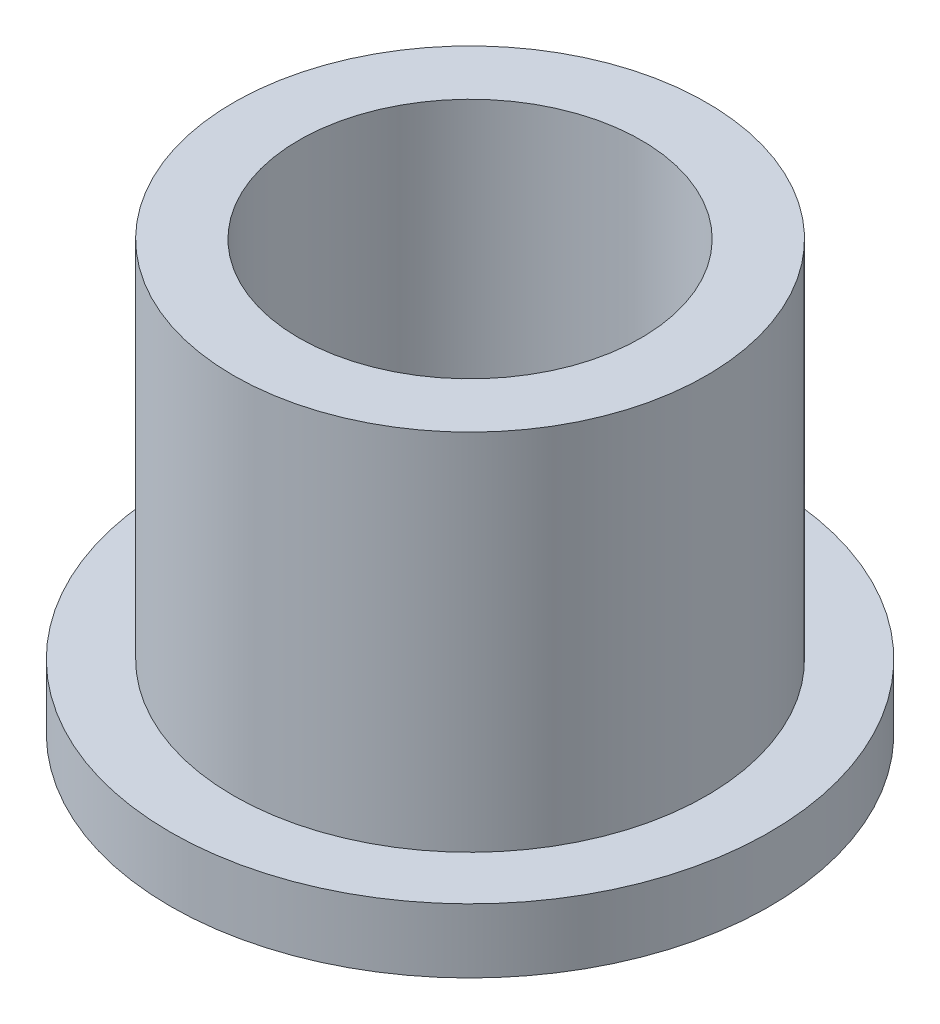
ISO-10303-21;
HEADER;
FILE_DESCRIPTION(('STEP AP214'),'2;1');
FILE_NAME('part.step','',(''),(''),'','','');
FILE_SCHEMA(('AUTOMOTIVE_DESIGN { 1 0 10303 214 1 1 1 1 }'));
ENDSEC;
DATA;
#1=APPLICATION_CONTEXT('core data for automotive mechanical design processes');
#2=APPLICATION_PROTOCOL_DEFINITION('international standard','automotive_design',2000,#1);
#3=PRODUCT_CONTEXT('',#1,'mechanical');
#4=PRODUCT('Part','Part','',(#3));
#5=PRODUCT_RELATED_PRODUCT_CATEGORY('part','',(#4));
#6=PRODUCT_DEFINITION_FORMATION('','',#4);
#7=PRODUCT_DEFINITION_CONTEXT('part definition',#1,'design');
#8=PRODUCT_DEFINITION('design','',#6,#7);
#9=PRODUCT_DEFINITION_SHAPE('','',#8);
#10=(LENGTH_UNIT() NAMED_UNIT(*) SI_UNIT(.MILLI.,.METRE.));
#11=(NAMED_UNIT(*) PLANE_ANGLE_UNIT() SI_UNIT($,.RADIAN.));
#12=(NAMED_UNIT(*) SI_UNIT($,.STERADIAN.) SOLID_ANGLE_UNIT());
#13=UNCERTAINTY_MEASURE_WITH_UNIT(LENGTH_MEASURE(1.E-05),#10,'distance_accuracy_value','');
#14=(GEOMETRIC_REPRESENTATION_CONTEXT(3) GLOBAL_UNCERTAINTY_ASSIGNED_CONTEXT((#13)) GLOBAL_UNIT_ASSIGNED_CONTEXT((#10,
#11,#12)) REPRESENTATION_CONTEXT('',''));
#15=CARTESIAN_POINT('',(0.,0.,0.));
#16=DIRECTION('',(0.,0.,1.));
#17=DIRECTION('',(1.,0.,0.));
#18=AXIS2_PLACEMENT_3D('',#15,#16,#17);
#19=CARTESIAN_POINT('',(0.,10.,0.));
#20=DIRECTION('',(0.,1.,0.));
#21=DIRECTION('',(0.,0.,1.));
#22=AXIS2_PLACEMENT_3D('',#19,#20,#21);
#23=PLANE('',#22);
#24=CARTESIAN_POINT('',(0.,10.,0.));
#25=DIRECTION('',(0.,1.,0.));
#26=DIRECTION('',(0.,0.,1.));
#27=AXIS2_PLACEMENT_3D('',#24,#25,#26);
#28=CIRCLE('',#27,5.525);
#29=CARTESIAN_POINT('',(0.,10.,5.525));
#30=VERTEX_POINT('',#29);
#31=EDGE_CURVE('E10',#30,#30,#28,.T.);
#32=ORIENTED_EDGE('',*,*,#31,.T.);
#33=EDGE_LOOP('',(#32));
#34=FACE_BOUND('',#33,.T.);
#35=CARTESIAN_POINT('',(0.,10.,0.));
#36=DIRECTION('',(0.,1.,0.));
#37=DIRECTION('',(0.,0.,1.));
#38=AXIS2_PLACEMENT_3D('',#35,#36,#37);
#39=CIRCLE('',#38,4.);
#40=CARTESIAN_POINT('',(0.,10.,4.));
#41=VERTEX_POINT('',#40);
#42=EDGE_CURVE('E39',#41,#41,#39,.T.);
#43=ORIENTED_EDGE('',*,*,#42,.F.);
#44=EDGE_LOOP('',(#43));
#45=FACE_BOUND('',#44,.T.);
#46=ADVANCED_FACE('F32',(#34,#45),#23,.T.);
#47=CARTESIAN_POINT('',(0.,0.,0.));
#48=DIRECTION('',(0.,1.,0.));
#49=DIRECTION('',(0.,0.,1.));
#50=AXIS2_PLACEMENT_3D('',#47,#48,#49);
#51=PLANE('',#50);
#52=CARTESIAN_POINT('',(0.,0.,0.));
#53=DIRECTION('',(0.,1.,0.));
#54=DIRECTION('',(0.,0.,1.));
#55=AXIS2_PLACEMENT_3D('',#52,#53,#54);
#56=CIRCLE('',#55,4.);
#57=CARTESIAN_POINT('',(0.,0.,4.));
#58=VERTEX_POINT('',#57);
#59=EDGE_CURVE('E43',#58,#58,#56,.T.);
#60=ORIENTED_EDGE('',*,*,#59,.T.);
#61=EDGE_LOOP('',(#60));
#62=FACE_BOUND('',#61,.T.);
#63=CARTESIAN_POINT('',(0.,0.,0.));
#64=DIRECTION('',(0.,1.,0.));
#65=DIRECTION('',(0.,0.,1.));
#66=AXIS2_PLACEMENT_3D('',#63,#64,#65);
#67=CIRCLE('',#66,7.);
#68=CARTESIAN_POINT('',(0.,0.,7.));
#69=VERTEX_POINT('',#68);
#70=EDGE_CURVE('E50',#69,#69,#67,.T.);
#71=ORIENTED_EDGE('',*,*,#70,.F.);
#72=EDGE_LOOP('',(#71));
#73=FACE_BOUND('',#72,.T.);
#74=ADVANCED_FACE('F75',(#62,#73),#51,.F.);
#75=CARTESIAN_POINT('',(0.,10.,0.));
#76=DIRECTION('',(0.,-1.,0.));
#77=DIRECTION('',(0.,0.,-1.));
#78=AXIS2_PLACEMENT_3D('',#75,#76,#77);
#79=CYLINDRICAL_SURFACE('',#78,5.525);
#80=CARTESIAN_POINT('',(0.,1.5,0.));
#81=DIRECTION('',(0.,1.,0.));
#82=DIRECTION('',(0.,0.,1.));
#83=AXIS2_PLACEMENT_3D('',#80,#81,#82);
#84=CIRCLE('',#83,5.525);
#85=CARTESIAN_POINT('',(0.,1.5,5.525));
#86=VERTEX_POINT('',#85);
#87=EDGE_CURVE('E53',#86,#86,#84,.T.);
#88=ORIENTED_EDGE('',*,*,#87,.T.);
#89=EDGE_LOOP('',(#88));
#90=FACE_BOUND('',#89,.T.);
#91=ORIENTED_EDGE('',*,*,#31,.F.);
#92=EDGE_LOOP('',(#91));
#93=FACE_BOUND('',#92,.T.);
#94=ADVANCED_FACE('F34',(#90,#93),#79,.T.);
#95=CARTESIAN_POINT('',(0.,10.,0.));
#96=DIRECTION('',(0.,-1.,0.));
#97=DIRECTION('',(0.,0.,-1.));
#98=AXIS2_PLACEMENT_3D('',#95,#96,#97);
#99=CYLINDRICAL_SURFACE('',#98,4.);
#100=ORIENTED_EDGE('',*,*,#42,.T.);
#101=EDGE_LOOP('',(#100));
#102=FACE_BOUND('',#101,.T.);
#103=ORIENTED_EDGE('',*,*,#59,.F.);
#104=EDGE_LOOP('',(#103));
#105=FACE_BOUND('',#104,.T.);
#106=ADVANCED_FACE('F64',(#102,#105),#99,.F.);
#107=CARTESIAN_POINT('',(0.,1.5,0.));
#108=DIRECTION('',(0.,1.,0.));
#109=DIRECTION('',(0.,0.,1.));
#110=AXIS2_PLACEMENT_3D('',#107,#108,#109);
#111=PLANE('',#110);
#112=CARTESIAN_POINT('',(0.,1.5,0.));
#113=DIRECTION('',(0.,1.,0.));
#114=DIRECTION('',(0.,0.,1.));
#115=AXIS2_PLACEMENT_3D('',#112,#113,#114);
#116=CIRCLE('',#115,7.);
#117=CARTESIAN_POINT('',(0.,1.5,7.));
#118=VERTEX_POINT('',#117);
#119=EDGE_CURVE('E48',#118,#118,#116,.T.);
#120=ORIENTED_EDGE('',*,*,#119,.T.);
#121=EDGE_LOOP('',(#120));
#122=FACE_BOUND('',#121,.T.);
#123=ORIENTED_EDGE('',*,*,#87,.F.);
#124=EDGE_LOOP('',(#123));
#125=FACE_BOUND('',#124,.T.);
#126=ADVANCED_FACE('F61',(#122,#125),#111,.T.);
#127=CARTESIAN_POINT('',(0.,1.5,0.));
#128=DIRECTION('',(0.,-1.,0.));
#129=DIRECTION('',(0.,0.,-1.));
#130=AXIS2_PLACEMENT_3D('',#127,#128,#129);
#131=CYLINDRICAL_SURFACE('',#130,7.);
#132=ORIENTED_EDGE('',*,*,#119,.F.);
#133=EDGE_LOOP('',(#132));
#134=FACE_BOUND('',#133,.T.);
#135=ORIENTED_EDGE('',*,*,#70,.T.);
#136=EDGE_LOOP('',(#135));
#137=FACE_BOUND('',#136,.T.);
#138=ADVANCED_FACE('F63',(#134,#137),#131,.T.);
#139=CLOSED_SHELL('',(#46,#74,#94,#106,#126,#138));
#140=MANIFOLD_SOLID_BREP('B2',#139);
#141=ADVANCED_BREP_SHAPE_REPRESENTATION('',(#18,#140),#14);
#142=SHAPE_DEFINITION_REPRESENTATION(#9,#141);
ENDSEC;
END-ISO-10303-21;
